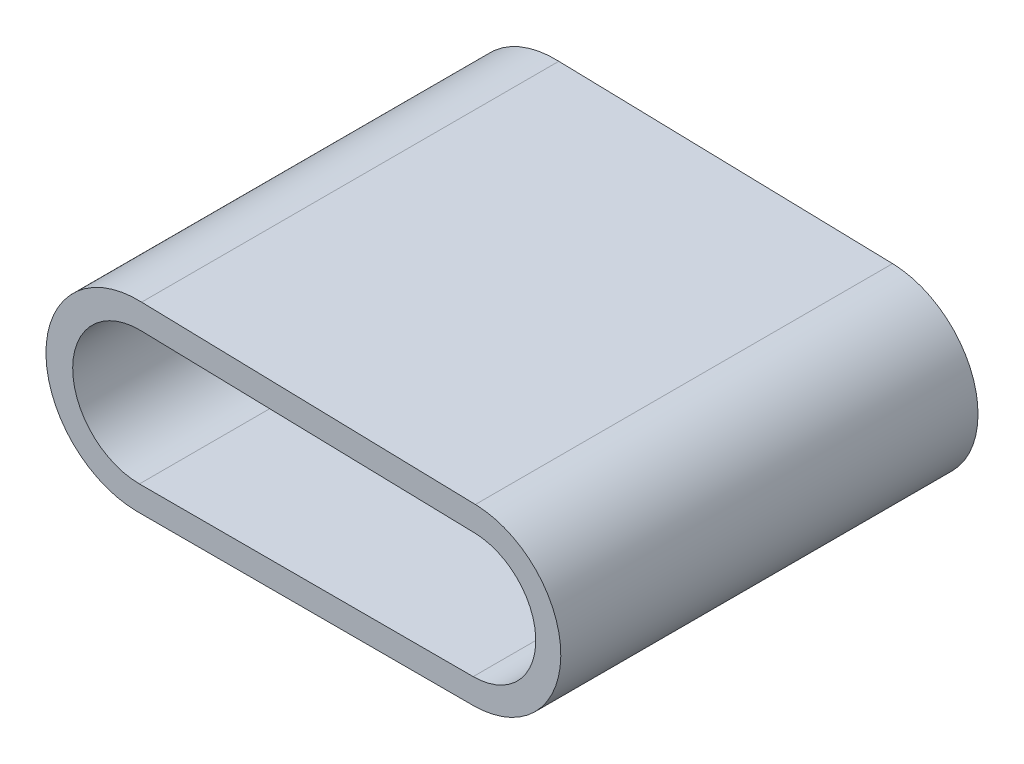
ISO-10303-21;
HEADER;
FILE_DESCRIPTION(('STEP AP214'),'2;1');
FILE_NAME('part.step','',(''),(''),'','','');
FILE_SCHEMA(('AUTOMOTIVE_DESIGN { 1 0 10303 214 1 1 1 1 }'));
ENDSEC;
DATA;
#1=APPLICATION_CONTEXT('core data for automotive mechanical design processes');
#2=APPLICATION_PROTOCOL_DEFINITION('international standard','automotive_design',2000,#1);
#3=PRODUCT_CONTEXT('',#1,'mechanical');
#4=PRODUCT('Part','Part','',(#3));
#5=PRODUCT_RELATED_PRODUCT_CATEGORY('part','',(#4));
#6=PRODUCT_DEFINITION_FORMATION('','',#4);
#7=PRODUCT_DEFINITION_CONTEXT('part definition',#1,'design');
#8=PRODUCT_DEFINITION('design','',#6,#7);
#9=PRODUCT_DEFINITION_SHAPE('','',#8);
#10=(LENGTH_UNIT() NAMED_UNIT(*) SI_UNIT(.MILLI.,.METRE.));
#11=(NAMED_UNIT(*) PLANE_ANGLE_UNIT() SI_UNIT($,.RADIAN.));
#12=(NAMED_UNIT(*) SI_UNIT($,.STERADIAN.) SOLID_ANGLE_UNIT());
#13=UNCERTAINTY_MEASURE_WITH_UNIT(LENGTH_MEASURE(1.E-05),#10,'distance_accuracy_value','');
#14=(GEOMETRIC_REPRESENTATION_CONTEXT(3) GLOBAL_UNCERTAINTY_ASSIGNED_CONTEXT((#13)) GLOBAL_UNIT_ASSIGNED_CONTEXT((#10,
#11,#12)) REPRESENTATION_CONTEXT('',''));
#15=CARTESIAN_POINT('',(0.,0.,0.));
#16=DIRECTION('',(0.,0.,1.));
#17=DIRECTION('',(1.,0.,0.));
#18=AXIS2_PLACEMENT_3D('',#15,#16,#17);
#19=CARTESIAN_POINT('',(-15.875,2.54,-15.875));
#20=DIRECTION('',(0.,0.,1.));
#21=DIRECTION('',(1.,0.,0.));
#22=AXIS2_PLACEMENT_3D('',#19,#20,#21);
#23=PLANE('',#22);
#24=CARTESIAN_POINT('',(-14.7613441445344,6.985,-15.875));
#25=DIRECTION('',(0.,0.,1.));
#26=DIRECTION('',(1.,0.,0.));
#27=AXIS2_PLACEMENT_3D('',#24,#25,#26);
#28=CIRCLE('',#27,5.08);
#29=CARTESIAN_POINT('',(-14.642301407796,12.0636050079554,-15.875));
#30=VERTEX_POINT('',#29);
#31=CARTESIAN_POINT('',(-14.7613441445344,1.905,-15.875));
#32=VERTEX_POINT('',#31);
#33=EDGE_CURVE('E175',#30,#32,#28,.T.);
#34=ORIENTED_EDGE('',*,*,#33,.T.);
#35=DIRECTION('',(1.,0.,0.));
#36=VECTOR('',#35,1.);
#37=CARTESIAN_POINT('',(0.,1.905,-15.875));
#38=LINE('',#37,#36);
#39=CARTESIAN_POINT('',(10.6386558554656,1.905,-15.875));
#40=VERTEX_POINT('',#39);
#41=EDGE_CURVE('E181',#32,#40,#38,.T.);
#42=ORIENTED_EDGE('',*,*,#41,.T.);
#43=CARTESIAN_POINT('',(10.6386558554656,6.6675,-15.875));
#44=DIRECTION('',(0.,0.,1.));
#45=DIRECTION('',(1.,0.,0.));
#46=AXIS2_PLACEMENT_3D('',#43,#44,#45);
#47=CIRCLE('',#46,4.7625);
#48=CARTESIAN_POINT('',(10.757698592204,11.4285119803283,-15.875));
#49=VERTEX_POINT('',#48);
#50=EDGE_CURVE('E160',#40,#49,#47,.T.);
#51=ORIENTED_EDGE('',*,*,#50,.T.);
#52=DIRECTION('',(0.999687554924582,-0.0249958502337866,0.));
#53=VECTOR('',#52,1.);
#54=CARTESIAN_POINT('',(0.292297448824718,11.6901853384969,-15.875));
#55=LINE('',#54,#53);
#56=EDGE_CURVE('E136',#30,#49,#55,.T.);
#57=ORIENTED_EDGE('',*,*,#56,.F.);
#58=EDGE_LOOP('',(#34,#42,#51,#57));
#59=FACE_BOUND('',#58,.T.);
#60=DIRECTION('',(-1.,0.,0.));
#61=VECTOR('',#60,1.);
#62=CARTESIAN_POINT('',(-15.875,0.,-15.875));
#63=LINE('',#62,#61);
#64=CARTESIAN_POINT('',(10.6386558554656,0.,-15.875));
#65=VERTEX_POINT('',#64);
#66=CARTESIAN_POINT('',(-15.0111277823064,0.,-15.875));
#67=VERTEX_POINT('',#66);
#68=EDGE_CURVE('E66',#65,#67,#63,.T.);
#69=ORIENTED_EDGE('',*,*,#68,.T.);
#70=CARTESIAN_POINT('',(-14.8862359634204,6.98648930545878,-15.875));
#71=DIRECTION('',(0.,0.,1.));
#72=DIRECTION('',(1.,0.,0.));
#73=AXIS2_PLACEMENT_3D('',#70,#71,#72);
#74=CIRCLE('',#73,6.98760551131176);
#75=CARTESIAN_POINT('',(-14.5946843131007,13.9680098000867,-15.875));
#76=VERTEX_POINT('',#75);
#77=EDGE_CURVE('E154',#76,#67,#74,.T.);
#78=ORIENTED_EDGE('',*,*,#77,.F.);
#79=DIRECTION('',(0.999687554924582,-0.0249958502337866,0.));
#80=VECTOR('',#79,1.);
#81=CARTESIAN_POINT('',(0.339914543520081,13.5945901306282,-15.875));
#82=LINE('',#81,#80);
#83=CARTESIAN_POINT('',(10.8053156868993,13.3329167724597,-15.875));
#84=VERTEX_POINT('',#83);
#85=EDGE_CURVE('E133',#76,#84,#82,.T.);
#86=ORIENTED_EDGE('',*,*,#85,.T.);
#87=CARTESIAN_POINT('',(10.6386558554656,6.6675,-15.875));
#88=DIRECTION('',(0.,0.,1.));
#89=DIRECTION('',(1.,0.,0.));
#90=AXIS2_PLACEMENT_3D('',#87,#88,#89);
#91=CIRCLE('',#90,6.6675);
#92=EDGE_CURVE('E129',#65,#84,#91,.T.);
#93=ORIENTED_EDGE('',*,*,#92,.F.);
#94=EDGE_LOOP('',(#69,#78,#86,#93));
#95=FACE_BOUND('',#94,.T.);
#96=ADVANCED_FACE('F58',(#59,#95),#23,.F.);
#97=CARTESIAN_POINT('',(-15.875,2.54,15.875));
#98=DIRECTION('',(0.,0.,-1.));
#99=DIRECTION('',(-1.,0.,0.));
#100=AXIS2_PLACEMENT_3D('',#97,#98,#99);
#101=PLANE('',#100);
#102=DIRECTION('',(1.,0.,0.));
#103=VECTOR('',#102,1.);
#104=CARTESIAN_POINT('',(0.,1.905,15.875));
#105=LINE('',#104,#103);
#106=CARTESIAN_POINT('',(-14.7613441445344,1.905,15.875));
#107=VERTEX_POINT('',#106);
#108=CARTESIAN_POINT('',(10.6386558554656,1.905,15.875));
#109=VERTEX_POINT('',#108);
#110=EDGE_CURVE('E143',#107,#109,#105,.T.);
#111=ORIENTED_EDGE('',*,*,#110,.F.);
#112=CARTESIAN_POINT('',(-14.7613441445344,6.985,15.875));
#113=DIRECTION('',(0.,0.,1.));
#114=DIRECTION('',(1.,0.,0.));
#115=AXIS2_PLACEMENT_3D('',#112,#113,#114);
#116=CIRCLE('',#115,5.08);
#117=CARTESIAN_POINT('',(-14.642301407796,12.0636050079554,15.875));
#118=VERTEX_POINT('',#117);
#119=EDGE_CURVE('E167',#118,#107,#116,.T.);
#120=ORIENTED_EDGE('',*,*,#119,.F.);
#121=DIRECTION('',(0.999687554924582,-0.0249958502337866,0.));
#122=VECTOR('',#121,1.);
#123=CARTESIAN_POINT('',(0.292297448824718,11.6901853384969,15.875));
#124=LINE('',#123,#122);
#125=CARTESIAN_POINT('',(10.757698592204,11.4285119803283,15.875));
#126=VERTEX_POINT('',#125);
#127=EDGE_CURVE('E164',#118,#126,#124,.T.);
#128=ORIENTED_EDGE('',*,*,#127,.T.);
#129=CARTESIAN_POINT('',(10.6386558554656,6.6675,15.875));
#130=DIRECTION('',(0.,0.,1.));
#131=DIRECTION('',(1.,0.,0.));
#132=AXIS2_PLACEMENT_3D('',#129,#130,#131);
#133=CIRCLE('',#132,4.7625);
#134=EDGE_CURVE('E169',#109,#126,#133,.T.);
#135=ORIENTED_EDGE('',*,*,#134,.F.);
#136=EDGE_LOOP('',(#111,#120,#128,#135));
#137=FACE_BOUND('',#136,.T.);
#138=CARTESIAN_POINT('',(-14.8862359634204,6.98648930545878,15.875));
#139=DIRECTION('',(0.,0.,1.));
#140=DIRECTION('',(1.,0.,0.));
#141=AXIS2_PLACEMENT_3D('',#138,#139,#140);
#142=CIRCLE('',#141,6.98760551131176);
#143=CARTESIAN_POINT('',(-14.5946843131007,13.9680098000867,15.875));
#144=VERTEX_POINT('',#143);
#145=CARTESIAN_POINT('',(-15.0111277823064,0.,15.875));
#146=VERTEX_POINT('',#145);
#147=EDGE_CURVE('E158',#144,#146,#142,.T.);
#148=ORIENTED_EDGE('',*,*,#147,.T.);
#149=DIRECTION('',(1.,0.,0.));
#150=VECTOR('',#149,1.);
#151=CARTESIAN_POINT('',(-15.875,0.,15.875));
#152=LINE('',#151,#150);
#153=CARTESIAN_POINT('',(10.6386558554656,0.,15.875));
#154=VERTEX_POINT('',#153);
#155=EDGE_CURVE('E12',#146,#154,#152,.T.);
#156=ORIENTED_EDGE('',*,*,#155,.T.);
#157=CARTESIAN_POINT('',(10.6386558554656,6.6675,15.875));
#158=DIRECTION('',(0.,0.,1.));
#159=DIRECTION('',(1.,0.,0.));
#160=AXIS2_PLACEMENT_3D('',#157,#158,#159);
#161=CIRCLE('',#160,6.6675);
#162=CARTESIAN_POINT('',(10.8053156868993,13.3329167724597,15.875));
#163=VERTEX_POINT('',#162);
#164=EDGE_CURVE('E92',#154,#163,#161,.T.);
#165=ORIENTED_EDGE('',*,*,#164,.T.);
#166=DIRECTION('',(0.999687554924582,-0.0249958502337866,0.));
#167=VECTOR('',#166,1.);
#168=CARTESIAN_POINT('',(0.339914543520081,13.5945901306282,15.875));
#169=LINE('',#168,#167);
#170=EDGE_CURVE('E161',#144,#163,#169,.T.);
#171=ORIENTED_EDGE('',*,*,#170,.F.);
#172=EDGE_LOOP('',(#148,#156,#165,#171));
#173=FACE_BOUND('',#172,.T.);
#174=ADVANCED_FACE('F189',(#137,#173),#101,.F.);
#175=CARTESIAN_POINT('',(0.,0.,0.));
#176=DIRECTION('',(0.,-1.,0.));
#177=DIRECTION('',(0.,0.,-1.));
#178=AXIS2_PLACEMENT_3D('',#175,#176,#177);
#179=PLANE('',#178);
#180=ORIENTED_EDGE('',*,*,#155,.F.);
#181=DIRECTION('',(0.,0.,1.));
#182=VECTOR('',#181,1.);
#183=CARTESIAN_POINT('',(-15.0111277823064,0.,-15.875));
#184=LINE('',#183,#182);
#185=EDGE_CURVE('E144',#67,#146,#184,.T.);
#186=ORIENTED_EDGE('',*,*,#185,.F.);
#187=ORIENTED_EDGE('',*,*,#68,.F.);
#188=DIRECTION('',(0.,0.,1.));
#189=VECTOR('',#188,1.);
#190=CARTESIAN_POINT('',(10.6386558554656,0.,-15.875));
#191=LINE('',#190,#189);
#192=EDGE_CURVE('E139',#65,#154,#191,.T.);
#193=ORIENTED_EDGE('',*,*,#192,.T.);
#194=EDGE_LOOP('',(#180,#186,#187,#193));
#195=FACE_BOUND('',#194,.T.);
#196=ADVANCED_FACE('F147',(#195),#179,.T.);
#197=CARTESIAN_POINT('',(-14.7613441445344,6.985,-15.875));
#198=DIRECTION('',(0.,0.,1.));
#199=DIRECTION('',(1.,0.,0.));
#200=AXIS2_PLACEMENT_3D('',#197,#198,#199);
#201=CYLINDRICAL_SURFACE('',#200,5.08);
#202=ORIENTED_EDGE('',*,*,#119,.T.);
#203=DIRECTION('',(0.,0.,1.));
#204=VECTOR('',#203,1.);
#205=CARTESIAN_POINT('',(-14.7613441445344,1.905,-15.875));
#206=LINE('',#205,#204);
#207=EDGE_CURVE('E171',#32,#107,#206,.T.);
#208=ORIENTED_EDGE('',*,*,#207,.F.);
#209=ORIENTED_EDGE('',*,*,#33,.F.);
#210=DIRECTION('',(0.,0.,1.));
#211=VECTOR('',#210,1.);
#212=CARTESIAN_POINT('',(-14.642301407796,12.0636050079554,-15.875));
#213=LINE('',#212,#211);
#214=EDGE_CURVE('E102',#30,#118,#213,.T.);
#215=ORIENTED_EDGE('',*,*,#214,.T.);
#216=EDGE_LOOP('',(#202,#208,#209,#215));
#217=FACE_BOUND('',#216,.T.);
#218=ADVANCED_FACE('F212',(#217),#201,.F.);
#219=CARTESIAN_POINT('',(10.6386558554656,6.6675,-15.875));
#220=DIRECTION('',(0.,0.,1.));
#221=DIRECTION('',(1.,0.,0.));
#222=AXIS2_PLACEMENT_3D('',#219,#220,#221);
#223=CYLINDRICAL_SURFACE('',#222,4.7625);
#224=ORIENTED_EDGE('',*,*,#50,.F.);
#225=DIRECTION('',(0.,0.,1.));
#226=VECTOR('',#225,1.);
#227=CARTESIAN_POINT('',(10.6386558554656,1.905,-15.875));
#228=LINE('',#227,#226);
#229=EDGE_CURVE('E178',#40,#109,#228,.T.);
#230=ORIENTED_EDGE('',*,*,#229,.T.);
#231=ORIENTED_EDGE('',*,*,#134,.T.);
#232=DIRECTION('',(0.,0.,1.));
#233=VECTOR('',#232,1.);
#234=CARTESIAN_POINT('',(10.757698592204,11.4285119803283,-15.875));
#235=LINE('',#234,#233);
#236=EDGE_CURVE('E153',#49,#126,#235,.T.);
#237=ORIENTED_EDGE('',*,*,#236,.F.);
#238=EDGE_LOOP('',(#224,#230,#231,#237));
#239=FACE_BOUND('',#238,.T.);
#240=ADVANCED_FACE('F218',(#239),#223,.F.);
#241=CARTESIAN_POINT('',(-14.8862359634204,6.98648930545878,-15.875));
#242=DIRECTION('',(0.,0.,1.));
#243=DIRECTION('',(1.,0.,0.));
#244=AXIS2_PLACEMENT_3D('',#241,#242,#243);
#245=CYLINDRICAL_SURFACE('',#244,6.98760551131176);
#246=ORIENTED_EDGE('',*,*,#77,.T.);
#247=ORIENTED_EDGE('',*,*,#185,.T.);
#248=ORIENTED_EDGE('',*,*,#147,.F.);
#249=DIRECTION('',(0.,0.,1.));
#250=VECTOR('',#249,1.);
#251=CARTESIAN_POINT('',(-14.5946843131007,13.9680098000867,-15.875));
#252=LINE('',#251,#250);
#253=EDGE_CURVE('E74',#76,#144,#252,.T.);
#254=ORIENTED_EDGE('',*,*,#253,.F.);
#255=EDGE_LOOP('',(#246,#247,#248,#254));
#256=FACE_BOUND('',#255,.T.);
#257=ADVANCED_FACE('F188',(#256),#245,.T.);
#258=CARTESIAN_POINT('',(10.6386558554656,6.6675,-15.875));
#259=DIRECTION('',(0.,0.,1.));
#260=DIRECTION('',(1.,0.,0.));
#261=AXIS2_PLACEMENT_3D('',#258,#259,#260);
#262=CYLINDRICAL_SURFACE('',#261,6.6675);
#263=ORIENTED_EDGE('',*,*,#164,.F.);
#264=ORIENTED_EDGE('',*,*,#192,.F.);
#265=ORIENTED_EDGE('',*,*,#92,.T.);
#266=DIRECTION('',(0.,0.,1.));
#267=VECTOR('',#266,1.);
#268=CARTESIAN_POINT('',(10.8053156868993,13.3329167724597,-15.875));
#269=LINE('',#268,#267);
#270=EDGE_CURVE('E149',#84,#163,#269,.T.);
#271=ORIENTED_EDGE('',*,*,#270,.T.);
#272=EDGE_LOOP('',(#263,#264,#265,#271));
#273=FACE_BOUND('',#272,.T.);
#274=ADVANCED_FACE('F140',(#273),#262,.T.);
#275=CARTESIAN_POINT('',(0.339914543520081,13.5945901306282,-15.875));
#276=DIRECTION('',(-0.0249958502337866,-0.999687554924582,0.));
#277=DIRECTION('',(0.999687554924582,-0.0249958502337866,0.));
#278=AXIS2_PLACEMENT_3D('',#275,#276,#277);
#279=PLANE('',#278);
#280=ORIENTED_EDGE('',*,*,#170,.T.);
#281=ORIENTED_EDGE('',*,*,#270,.F.);
#282=ORIENTED_EDGE('',*,*,#85,.F.);
#283=ORIENTED_EDGE('',*,*,#253,.T.);
#284=EDGE_LOOP('',(#280,#281,#282,#283));
#285=FACE_BOUND('',#284,.T.);
#286=ADVANCED_FACE('F190',(#285),#279,.F.);
#287=CARTESIAN_POINT('',(0.292297448824718,11.6901853384969,-15.875));
#288=DIRECTION('',(-0.0249958502337866,-0.999687554924582,0.));
#289=DIRECTION('',(0.999687554924582,-0.0249958502337866,0.));
#290=AXIS2_PLACEMENT_3D('',#287,#288,#289);
#291=PLANE('',#290);
#292=ORIENTED_EDGE('',*,*,#127,.F.);
#293=ORIENTED_EDGE('',*,*,#214,.F.);
#294=ORIENTED_EDGE('',*,*,#56,.T.);
#295=ORIENTED_EDGE('',*,*,#236,.T.);
#296=EDGE_LOOP('',(#292,#293,#294,#295));
#297=FACE_BOUND('',#296,.T.);
#298=ADVANCED_FACE('F192',(#297),#291,.T.);
#299=CARTESIAN_POINT('',(0.,1.905,-15.875));
#300=DIRECTION('',(0.,-1.,0.));
#301=DIRECTION('',(1.,0.,0.));
#302=AXIS2_PLACEMENT_3D('',#299,#300,#301);
#303=PLANE('',#302);
#304=ORIENTED_EDGE('',*,*,#110,.T.);
#305=ORIENTED_EDGE('',*,*,#229,.F.);
#306=ORIENTED_EDGE('',*,*,#41,.F.);
#307=ORIENTED_EDGE('',*,*,#207,.T.);
#308=EDGE_LOOP('',(#304,#305,#306,#307));
#309=FACE_BOUND('',#308,.T.);
#310=ADVANCED_FACE('F198',(#309),#303,.F.);
#311=CLOSED_SHELL('',(#96,#174,#196,#218,#240,#257,#274,#286,#298,#310));
#312=MANIFOLD_SOLID_BREP('B2',#311);
#313=ADVANCED_BREP_SHAPE_REPRESENTATION('',(#18,#312),#14);
#314=SHAPE_DEFINITION_REPRESENTATION(#9,#313);
ENDSEC;
END-ISO-10303-21;
